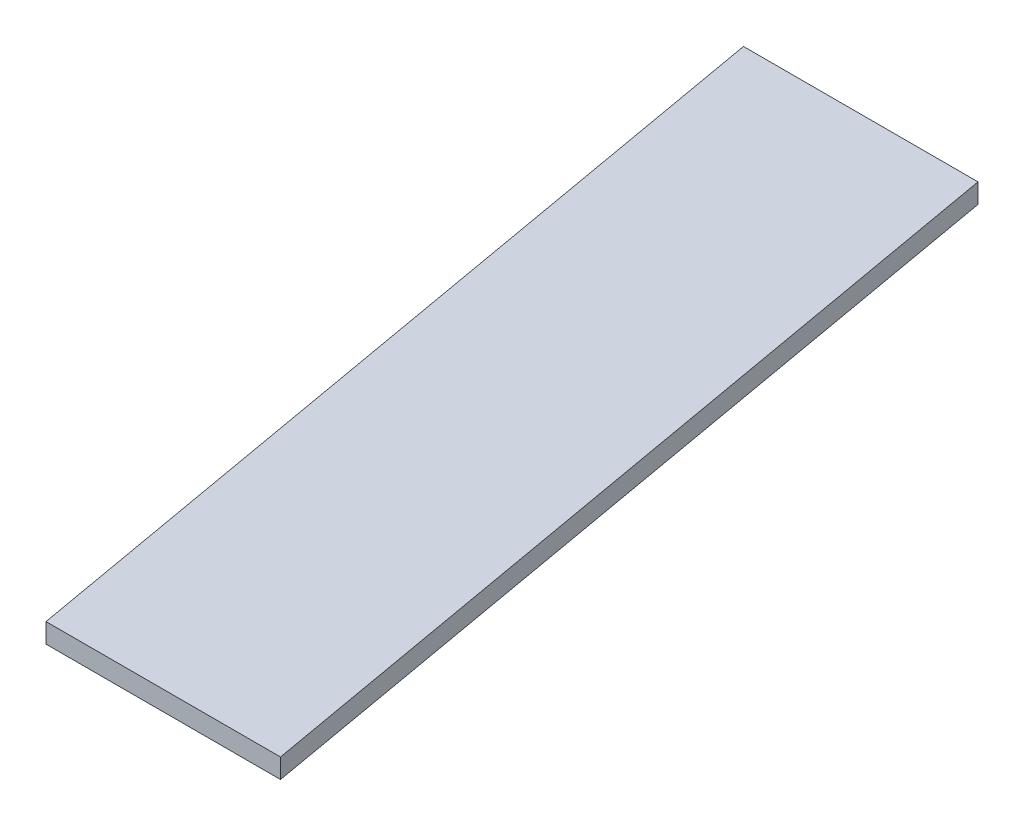
ISO-10303-21;
HEADER;
FILE_DESCRIPTION(('STEP AP214'),'2;1');
FILE_NAME('part.step','',(''),(''),'','','');
FILE_SCHEMA(('AUTOMOTIVE_DESIGN { 1 0 10303 214 1 1 1 1 }'));
ENDSEC;
DATA;
#1=APPLICATION_CONTEXT('core data for automotive mechanical design processes');
#2=APPLICATION_PROTOCOL_DEFINITION('international standard','automotive_design',2000,#1);
#3=PRODUCT_CONTEXT('',#1,'mechanical');
#4=PRODUCT('Part','Part','',(#3));
#5=PRODUCT_RELATED_PRODUCT_CATEGORY('part','',(#4));
#6=PRODUCT_DEFINITION_FORMATION('','',#4);
#7=PRODUCT_DEFINITION_CONTEXT('part definition',#1,'design');
#8=PRODUCT_DEFINITION('design','',#6,#7);
#9=PRODUCT_DEFINITION_SHAPE('','',#8);
#10=(LENGTH_UNIT() NAMED_UNIT(*) SI_UNIT(.MILLI.,.METRE.));
#11=(NAMED_UNIT(*) PLANE_ANGLE_UNIT() SI_UNIT($,.RADIAN.));
#12=(NAMED_UNIT(*) SI_UNIT($,.STERADIAN.) SOLID_ANGLE_UNIT());
#13=UNCERTAINTY_MEASURE_WITH_UNIT(LENGTH_MEASURE(1.E-05),#10,'distance_accuracy_value','');
#14=(GEOMETRIC_REPRESENTATION_CONTEXT(3) GLOBAL_UNCERTAINTY_ASSIGNED_CONTEXT((#13)) GLOBAL_UNIT_ASSIGNED_CONTEXT((#10,
#11,#12)) REPRESENTATION_CONTEXT('',''));
#15=CARTESIAN_POINT('',(0.,0.,0.));
#16=DIRECTION('',(0.,0.,1.));
#17=DIRECTION('',(1.,0.,0.));
#18=AXIS2_PLACEMENT_3D('',#15,#16,#17);
#19=CARTESIAN_POINT('',(38.1,3.175,0.));
#20=DIRECTION('',(0.,0.,-1.));
#21=DIRECTION('',(-1.,0.,0.));
#22=AXIS2_PLACEMENT_3D('',#19,#20,#21);
#23=PLANE('',#22);
#24=DIRECTION('',(1.,0.,0.));
#25=VECTOR('',#24,1.);
#26=CARTESIAN_POINT('',(38.1,0.,0.));
#27=LINE('',#26,#25);
#28=CARTESIAN_POINT('',(0.,0.,0.));
#29=VERTEX_POINT('',#28);
#30=CARTESIAN_POINT('',(38.1,0.,0.));
#31=VERTEX_POINT('',#30);
#32=EDGE_CURVE('E103',#29,#31,#27,.T.);
#33=ORIENTED_EDGE('',*,*,#32,.T.);
#34=DIRECTION('',(0.,-1.,0.));
#35=VECTOR('',#34,1.);
#36=CARTESIAN_POINT('',(38.1,3.175,0.));
#37=LINE('',#36,#35);
#38=CARTESIAN_POINT('',(38.1,3.175,0.));
#39=VERTEX_POINT('',#38);
#40=EDGE_CURVE('E11',#39,#31,#37,.T.);
#41=ORIENTED_EDGE('',*,*,#40,.F.);
#42=DIRECTION('',(1.,0.,0.));
#43=VECTOR('',#42,1.);
#44=CARTESIAN_POINT('',(38.1,3.175,0.));
#45=LINE('',#44,#43);
#46=CARTESIAN_POINT('',(0.,3.175,0.));
#47=VERTEX_POINT('',#46);
#48=EDGE_CURVE('E91',#47,#39,#45,.T.);
#49=ORIENTED_EDGE('',*,*,#48,.F.);
#50=DIRECTION('',(0.,-1.,0.));
#51=VECTOR('',#50,1.);
#52=CARTESIAN_POINT('',(0.,3.175,0.));
#53=LINE('',#52,#51);
#54=EDGE_CURVE('E99',#47,#29,#53,.T.);
#55=ORIENTED_EDGE('',*,*,#54,.T.);
#56=EDGE_LOOP('',(#33,#41,#49,#55));
#57=FACE_BOUND('',#56,.T.);
#58=ADVANCED_FACE('F40',(#57),#23,.F.);
#59=CARTESIAN_POINT('',(13.8413495799303,3.175,-137.577643095806));
#60=DIRECTION('',(-0.984807753012209,0.,0.173648177666927));
#61=DIRECTION('',(0.173648177666927,0.,0.984807753012209));
#62=AXIS2_PLACEMENT_3D('',#59,#60,#61);
#63=PLANE('',#62);
#64=DIRECTION('',(-0.173648177666927,0.,-0.984807753012209));
#65=VECTOR('',#64,1.);
#66=CARTESIAN_POINT('',(13.8413495799303,0.,-137.577643095806));
#67=LINE('',#66,#65);
#68=CARTESIAN_POINT('',(13.8413495799303,0.,-137.577643095806));
#69=VERTEX_POINT('',#68);
#70=EDGE_CURVE('E95',#31,#69,#67,.T.);
#71=ORIENTED_EDGE('',*,*,#70,.T.);
#72=DIRECTION('',(0.,-1.,0.));
#73=VECTOR('',#72,1.);
#74=CARTESIAN_POINT('',(13.8413495799303,3.175,-137.577643095806));
#75=LINE('',#74,#73);
#76=CARTESIAN_POINT('',(13.8413495799303,3.175,-137.577643095806));
#77=VERTEX_POINT('',#76);
#78=EDGE_CURVE('E48',#77,#69,#75,.T.);
#79=ORIENTED_EDGE('',*,*,#78,.F.);
#80=DIRECTION('',(-0.173648177666927,0.,-0.984807753012209));
#81=VECTOR('',#80,1.);
#82=CARTESIAN_POINT('',(13.8413495799303,3.175,-137.577643095806));
#83=LINE('',#82,#81);
#84=EDGE_CURVE('E86',#39,#77,#83,.T.);
#85=ORIENTED_EDGE('',*,*,#84,.F.);
#86=ORIENTED_EDGE('',*,*,#40,.T.);
#87=EDGE_LOOP('',(#71,#79,#85,#86));
#88=FACE_BOUND('',#87,.T.);
#89=ADVANCED_FACE('F94',(#88),#63,.F.);
#90=CARTESIAN_POINT('',(-24.2586504200697,3.175,-137.577643095806));
#91=DIRECTION('',(0.,0.,1.));
#92=DIRECTION('',(1.,0.,0.));
#93=AXIS2_PLACEMENT_3D('',#90,#91,#92);
#94=PLANE('',#93);
#95=DIRECTION('',(-1.,0.,0.));
#96=VECTOR('',#95,1.);
#97=CARTESIAN_POINT('',(-24.2586504200697,0.,-137.577643095806));
#98=LINE('',#97,#96);
#99=CARTESIAN_POINT('',(-24.2586504200697,0.,-137.577643095806));
#100=VERTEX_POINT('',#99);
#101=EDGE_CURVE('E73',#69,#100,#98,.T.);
#102=ORIENTED_EDGE('',*,*,#101,.T.);
#103=DIRECTION('',(0.,-1.,0.));
#104=VECTOR('',#103,1.);
#105=CARTESIAN_POINT('',(-24.2586504200697,3.175,-137.577643095806));
#106=LINE('',#105,#104);
#107=CARTESIAN_POINT('',(-24.2586504200697,3.175,-137.577643095806));
#108=VERTEX_POINT('',#107);
#109=EDGE_CURVE('E96',#108,#100,#106,.T.);
#110=ORIENTED_EDGE('',*,*,#109,.F.);
#111=DIRECTION('',(-1.,0.,0.));
#112=VECTOR('',#111,1.);
#113=CARTESIAN_POINT('',(-24.2586504200697,3.175,-137.577643095806));
#114=LINE('',#113,#112);
#115=EDGE_CURVE('E89',#77,#108,#114,.T.);
#116=ORIENTED_EDGE('',*,*,#115,.F.);
#117=ORIENTED_EDGE('',*,*,#78,.T.);
#118=EDGE_LOOP('',(#102,#110,#116,#117));
#119=FACE_BOUND('',#118,.T.);
#120=ADVANCED_FACE('F97',(#119),#94,.F.);
#121=CARTESIAN_POINT('',(0.,3.175,0.));
#122=DIRECTION('',(0.984807753012209,0.,-0.173648177666927));
#123=DIRECTION('',(-0.173648177666927,0.,-0.984807753012209));
#124=AXIS2_PLACEMENT_3D('',#121,#122,#123);
#125=PLANE('',#124);
#126=DIRECTION('',(0.173648177666927,0.,0.984807753012209));
#127=VECTOR('',#126,1.);
#128=CARTESIAN_POINT('',(0.,0.,0.));
#129=LINE('',#128,#127);
#130=EDGE_CURVE('E79',#100,#29,#129,.T.);
#131=ORIENTED_EDGE('',*,*,#130,.T.);
#132=ORIENTED_EDGE('',*,*,#54,.F.);
#133=DIRECTION('',(0.173648177666927,0.,0.984807753012209));
#134=VECTOR('',#133,1.);
#135=CARTESIAN_POINT('',(0.,3.175,0.));
#136=LINE('',#135,#134);
#137=EDGE_CURVE('E56',#108,#47,#136,.T.);
#138=ORIENTED_EDGE('',*,*,#137,.F.);
#139=ORIENTED_EDGE('',*,*,#109,.T.);
#140=EDGE_LOOP('',(#131,#132,#138,#139));
#141=FACE_BOUND('',#140,.T.);
#142=ADVANCED_FACE('F110',(#141),#125,.F.);
#143=CARTESIAN_POINT('',(0.,3.175,0.));
#144=DIRECTION('',(0.,-1.,0.));
#145=DIRECTION('',(0.,0.,-1.));
#146=AXIS2_PLACEMENT_3D('',#143,#144,#145);
#147=PLANE('',#146);
#148=ORIENTED_EDGE('',*,*,#48,.T.);
#149=ORIENTED_EDGE('',*,*,#84,.T.);
#150=ORIENTED_EDGE('',*,*,#115,.T.);
#151=ORIENTED_EDGE('',*,*,#137,.T.);
#152=EDGE_LOOP('',(#148,#149,#150,#151));
#153=FACE_BOUND('',#152,.T.);
#154=ADVANCED_FACE('F87',(#153),#147,.F.);
#155=CARTESIAN_POINT('',(0.,0.,0.));
#156=DIRECTION('',(0.,-1.,0.));
#157=DIRECTION('',(0.,0.,-1.));
#158=AXIS2_PLACEMENT_3D('',#155,#156,#157);
#159=PLANE('',#158);
#160=ORIENTED_EDGE('',*,*,#32,.F.);
#161=ORIENTED_EDGE('',*,*,#130,.F.);
#162=ORIENTED_EDGE('',*,*,#101,.F.);
#163=ORIENTED_EDGE('',*,*,#70,.F.);
#164=EDGE_LOOP('',(#160,#161,#162,#163));
#165=FACE_BOUND('',#164,.T.);
#166=ADVANCED_FACE('F113',(#165),#159,.T.);
#167=CLOSED_SHELL('',(#58,#89,#120,#142,#154,#166));
#168=MANIFOLD_SOLID_BREP('B2',#167);
#169=ADVANCED_BREP_SHAPE_REPRESENTATION('',(#18,#168),#14);
#170=SHAPE_DEFINITION_REPRESENTATION(#9,#169);
ENDSEC;
END-ISO-10303-21;
